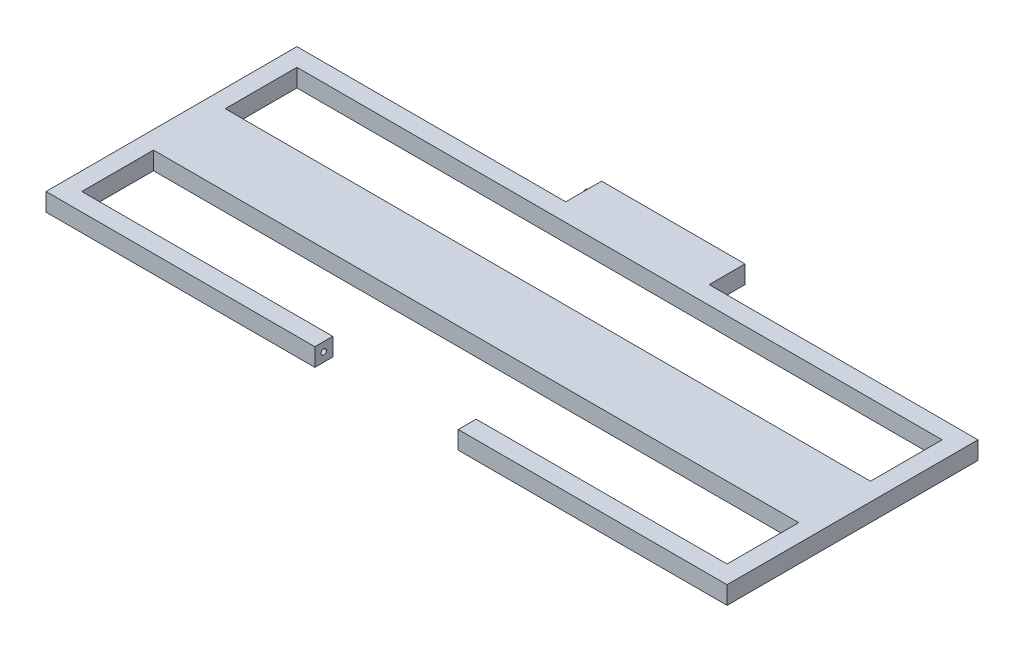
ISO-10303-21;
HEADER;
FILE_DESCRIPTION(('STEP AP214'),'2;1');
FILE_NAME('part.step','',(''),(''),'','','');
FILE_SCHEMA(('AUTOMOTIVE_DESIGN { 1 0 10303 214 1 1 1 1 }'));
ENDSEC;
DATA;
#1=APPLICATION_CONTEXT('core data for automotive mechanical design processes');
#2=APPLICATION_PROTOCOL_DEFINITION('international standard','automotive_design',2000,#1);
#3=PRODUCT_CONTEXT('',#1,'mechanical');
#4=PRODUCT('Part','Part','',(#3));
#5=PRODUCT_RELATED_PRODUCT_CATEGORY('part','',(#4));
#6=PRODUCT_DEFINITION_FORMATION('','',#4);
#7=PRODUCT_DEFINITION_CONTEXT('part definition',#1,'design');
#8=PRODUCT_DEFINITION('design','',#6,#7);
#9=PRODUCT_DEFINITION_SHAPE('','',#8);
#10=(LENGTH_UNIT() NAMED_UNIT(*) SI_UNIT(.MILLI.,.METRE.));
#11=(NAMED_UNIT(*) PLANE_ANGLE_UNIT() SI_UNIT($,.RADIAN.));
#12=(NAMED_UNIT(*) SI_UNIT($,.STERADIAN.) SOLID_ANGLE_UNIT());
#13=UNCERTAINTY_MEASURE_WITH_UNIT(LENGTH_MEASURE(1.E-05),#10,'distance_accuracy_value','');
#14=(GEOMETRIC_REPRESENTATION_CONTEXT(3) GLOBAL_UNCERTAINTY_ASSIGNED_CONTEXT((#13)) GLOBAL_UNIT_ASSIGNED_CONTEXT((#10,
#11,#12)) REPRESENTATION_CONTEXT('',''));
#15=CARTESIAN_POINT('',(0.,0.,0.));
#16=DIRECTION('',(0.,0.,1.));
#17=DIRECTION('',(1.,0.,0.));
#18=AXIS2_PLACEMENT_3D('',#15,#16,#17);
#19=CARTESIAN_POINT('',(0.,0.,250.));
#20=DIRECTION('',(0.,0.,1.));
#21=DIRECTION('',(1.,0.,0.));
#22=AXIS2_PLACEMENT_3D('',#19,#20,#21);
#23=PLANE('',#22);
#24=DIRECTION('',(0.,1.,0.));
#25=VECTOR('',#24,1.);
#26=CARTESIAN_POINT('',(-100.,0.,250.));
#27=LINE('',#26,#25);
#28=CARTESIAN_POINT('',(-99.9999999999998,0.,250.));
#29=VERTEX_POINT('',#28);
#30=CARTESIAN_POINT('',(-99.9999999999998,25.,250.));
#31=VERTEX_POINT('',#30);
#32=EDGE_CURVE('E395',#29,#31,#27,.T.);
#33=ORIENTED_EDGE('',*,*,#32,.F.);
#34=DIRECTION('',(-1.,0.,0.));
#35=VECTOR('',#34,1.);
#36=CARTESIAN_POINT('',(475.,0.,250.));
#37=LINE('',#36,#35);
#38=CARTESIAN_POINT('',(-475.,0.,250.));
#39=VERTEX_POINT('',#38);
#40=EDGE_CURVE('E401',#29,#39,#37,.T.);
#41=ORIENTED_EDGE('',*,*,#40,.T.);
#42=DIRECTION('',(0.,1.,0.));
#43=VECTOR('',#42,1.);
#44=CARTESIAN_POINT('',(-475.,0.,250.));
#45=LINE('',#44,#43);
#46=CARTESIAN_POINT('',(-475.,25.,250.));
#47=VERTEX_POINT('',#46);
#48=EDGE_CURVE('E410',#39,#47,#45,.T.);
#49=ORIENTED_EDGE('',*,*,#48,.T.);
#50=DIRECTION('',(1.,0.,0.));
#51=VECTOR('',#50,1.);
#52=CARTESIAN_POINT('',(475.,25.,250.));
#53=LINE('',#52,#51);
#54=EDGE_CURVE('E257',#47,#31,#53,.T.);
#55=ORIENTED_EDGE('',*,*,#54,.T.);
#56=EDGE_LOOP('',(#33,#41,#49,#55));
#57=FACE_BOUND('',#56,.T.);
#58=ADVANCED_FACE('F233',(#57),#23,.F.);
#59=DIRECTION('',(0.,-1.,0.));
#60=VECTOR('',#59,1.);
#61=CARTESIAN_POINT('',(100.,0.,250.));
#62=LINE('',#61,#60);
#63=CARTESIAN_POINT('',(100.,25.,250.));
#64=VERTEX_POINT('',#63);
#65=CARTESIAN_POINT('',(100.,0.,250.));
#66=VERTEX_POINT('',#65);
#67=EDGE_CURVE('E249',#64,#66,#62,.T.);
#68=ORIENTED_EDGE('',*,*,#67,.F.);
#69=CARTESIAN_POINT('',(475.,25.,250.));
#70=VERTEX_POINT('',#69);
#71=EDGE_CURVE('E413',#64,#70,#53,.T.);
#72=ORIENTED_EDGE('',*,*,#71,.T.);
#73=DIRECTION('',(0.,-1.,0.));
#74=VECTOR('',#73,1.);
#75=CARTESIAN_POINT('',(475.,0.,250.));
#76=LINE('',#75,#74);
#77=CARTESIAN_POINT('',(475.,0.,250.));
#78=VERTEX_POINT('',#77);
#79=EDGE_CURVE('E397',#70,#78,#76,.T.);
#80=ORIENTED_EDGE('',*,*,#79,.T.);
#81=EDGE_CURVE('E407',#78,#66,#37,.T.);
#82=ORIENTED_EDGE('',*,*,#81,.T.);
#83=EDGE_LOOP('',(#68,#72,#80,#82));
#84=FACE_BOUND('',#83,.T.);
#85=ADVANCED_FACE('F622',(#84),#23,.F.);
#86=CARTESIAN_POINT('',(0.,25.,475.));
#87=DIRECTION('',(0.,0.,-1.));
#88=DIRECTION('',(-1.,0.,0.));
#89=AXIS2_PLACEMENT_3D('',#86,#87,#88);
#90=PLANE('',#89);
#91=DIRECTION('',(1.,0.,0.));
#92=VECTOR('',#91,1.);
#93=CARTESIAN_POINT('',(0.,0.,475.));
#94=LINE('',#93,#92);
#95=CARTESIAN_POINT('',(-450.,0.,475.));
#96=VERTEX_POINT('',#95);
#97=CARTESIAN_POINT('',(450.,0.,475.));
#98=VERTEX_POINT('',#97);
#99=EDGE_CURVE('E435',#96,#98,#94,.T.);
#100=ORIENTED_EDGE('',*,*,#99,.T.);
#101=DIRECTION('',(0.,-1.,0.));
#102=VECTOR('',#101,1.);
#103=CARTESIAN_POINT('',(450.,25.,475.));
#104=LINE('',#103,#102);
#105=CARTESIAN_POINT('',(450.,25.,475.));
#106=VERTEX_POINT('',#105);
#107=EDGE_CURVE('E448',#106,#98,#104,.T.);
#108=ORIENTED_EDGE('',*,*,#107,.F.);
#109=DIRECTION('',(1.,0.,0.));
#110=VECTOR('',#109,1.);
#111=CARTESIAN_POINT('',(0.,25.,475.));
#112=LINE('',#111,#110);
#113=CARTESIAN_POINT('',(-450.,25.,475.));
#114=VERTEX_POINT('',#113);
#115=EDGE_CURVE('E425',#114,#106,#112,.T.);
#116=ORIENTED_EDGE('',*,*,#115,.F.);
#117=DIRECTION('',(0.,-1.,0.));
#118=VECTOR('',#117,1.);
#119=CARTESIAN_POINT('',(-450.,25.,475.));
#120=LINE('',#119,#118);
#121=EDGE_CURVE('E242',#114,#96,#120,.T.);
#122=ORIENTED_EDGE('',*,*,#121,.T.);
#123=EDGE_LOOP('',(#100,#108,#116,#122));
#124=FACE_BOUND('',#123,.T.);
#125=ADVANCED_FACE('F598',(#124),#90,.F.);
#126=CARTESIAN_POINT('',(0.,25.,375.));
#127=DIRECTION('',(0.,0.,-1.));
#128=DIRECTION('',(-1.,0.,0.));
#129=AXIS2_PLACEMENT_3D('',#126,#127,#128);
#130=PLANE('',#129);
#131=DIRECTION('',(1.,0.,0.));
#132=VECTOR('',#131,1.);
#133=CARTESIAN_POINT('',(0.,0.,375.));
#134=LINE('',#133,#132);
#135=CARTESIAN_POINT('',(-450.,0.,375.));
#136=VERTEX_POINT('',#135);
#137=CARTESIAN_POINT('',(450.,0.,375.));
#138=VERTEX_POINT('',#137);
#139=EDGE_CURVE('E430',#136,#138,#134,.T.);
#140=ORIENTED_EDGE('',*,*,#139,.F.);
#141=DIRECTION('',(0.,-1.,0.));
#142=VECTOR('',#141,1.);
#143=CARTESIAN_POINT('',(-450.,25.,375.));
#144=LINE('',#143,#142);
#145=CARTESIAN_POINT('',(-450.,25.,375.));
#146=VERTEX_POINT('',#145);
#147=EDGE_CURVE('E434',#146,#136,#144,.T.);
#148=ORIENTED_EDGE('',*,*,#147,.F.);
#149=DIRECTION('',(1.,0.,0.));
#150=VECTOR('',#149,1.);
#151=CARTESIAN_POINT('',(0.,25.,375.));
#152=LINE('',#151,#150);
#153=CARTESIAN_POINT('',(450.,25.,375.));
#154=VERTEX_POINT('',#153);
#155=EDGE_CURVE('E429',#146,#154,#152,.T.);
#156=ORIENTED_EDGE('',*,*,#155,.T.);
#157=DIRECTION('',(0.,-1.,0.));
#158=VECTOR('',#157,1.);
#159=CARTESIAN_POINT('',(450.,25.,375.));
#160=LINE('',#159,#158);
#161=EDGE_CURVE('E445',#154,#138,#160,.T.);
#162=ORIENTED_EDGE('',*,*,#161,.T.);
#163=EDGE_LOOP('',(#140,#148,#156,#162));
#164=FACE_BOUND('',#163,.T.);
#165=ADVANCED_FACE('F678',(#164),#130,.T.);
#166=CARTESIAN_POINT('',(0.,0.,0.));
#167=DIRECTION('',(0.,1.,0.));
#168=DIRECTION('',(0.,0.,1.));
#169=AXIS2_PLACEMENT_3D('',#166,#167,#168);
#170=PLANE('',#169);
#171=DIRECTION('',(0.,0.,-1.));
#172=VECTOR('',#171,1.);
#173=CARTESIAN_POINT('',(-450.,0.,575.));
#174=LINE('',#173,#172);
#175=CARTESIAN_POINT('',(-450.,0.,275.));
#176=VERTEX_POINT('',#175);
#177=EDGE_CURVE('E522',#136,#176,#174,.T.);
#178=ORIENTED_EDGE('',*,*,#177,.F.);
#179=ORIENTED_EDGE('',*,*,#139,.T.);
#180=DIRECTION('',(0.,0.,-1.));
#181=VECTOR('',#180,1.);
#182=CARTESIAN_POINT('',(450.,0.,575.));
#183=LINE('',#182,#181);
#184=CARTESIAN_POINT('',(450.,0.,275.));
#185=VERTEX_POINT('',#184);
#186=EDGE_CURVE('E527',#138,#185,#183,.T.);
#187=ORIENTED_EDGE('',*,*,#186,.T.);
#188=DIRECTION('',(1.,0.,0.));
#189=VECTOR('',#188,1.);
#190=CARTESIAN_POINT('',(0.,0.,275.));
#191=LINE('',#190,#189);
#192=EDGE_CURVE('E458',#176,#185,#191,.T.);
#193=ORIENTED_EDGE('',*,*,#192,.F.);
#194=EDGE_LOOP('',(#178,#179,#187,#193));
#195=FACE_BOUND('',#194,.T.);
#196=DIRECTION('',(0.,0.,-1.));
#197=VECTOR('',#196,1.);
#198=CARTESIAN_POINT('',(-475.,0.,600.));
#199=LINE('',#198,#197);
#200=CARTESIAN_POINT('',(-475.,0.,600.));
#201=VERTEX_POINT('',#200);
#202=EDGE_CURVE('E474',#201,#39,#199,.T.);
#203=ORIENTED_EDGE('',*,*,#202,.T.);
#204=ORIENTED_EDGE('',*,*,#40,.F.);
#205=DIRECTION('',(0.,0.,1.));
#206=VECTOR('',#205,1.);
#207=CARTESIAN_POINT('',(-100.,0.,200.));
#208=LINE('',#207,#206);
#209=CARTESIAN_POINT('',(-100.,0.,200.));
#210=VERTEX_POINT('',#209);
#211=EDGE_CURVE('E627',#210,#29,#208,.T.);
#212=ORIENTED_EDGE('',*,*,#211,.F.);
#213=DIRECTION('',(-1.,0.,0.));
#214=VECTOR('',#213,1.);
#215=CARTESIAN_POINT('',(100.,0.,200.));
#216=LINE('',#215,#214);
#217=CARTESIAN_POINT('',(100.,0.,200.));
#218=VERTEX_POINT('',#217);
#219=EDGE_CURVE('E388',#218,#210,#216,.T.);
#220=ORIENTED_EDGE('',*,*,#219,.F.);
#221=DIRECTION('',(0.,0.,1.));
#222=VECTOR('',#221,1.);
#223=CARTESIAN_POINT('',(100.,0.,200.));
#224=LINE('',#223,#222);
#225=EDGE_CURVE('E403',#218,#66,#224,.T.);
#226=ORIENTED_EDGE('',*,*,#225,.T.);
#227=ORIENTED_EDGE('',*,*,#81,.F.);
#228=DIRECTION('',(0.,0.,-1.));
#229=VECTOR('',#228,1.);
#230=CARTESIAN_POINT('',(475.,0.,600.));
#231=LINE('',#230,#229);
#232=CARTESIAN_POINT('',(475.,0.,600.));
#233=VERTEX_POINT('',#232);
#234=EDGE_CURVE('E543',#233,#78,#231,.T.);
#235=ORIENTED_EDGE('',*,*,#234,.F.);
#236=DIRECTION('',(1.,0.,0.));
#237=VECTOR('',#236,1.);
#238=CARTESIAN_POINT('',(99.9999999999999,0.,600.));
#239=LINE('',#238,#237);
#240=CARTESIAN_POINT('',(99.9999999999999,0.,600.));
#241=VERTEX_POINT('',#240);
#242=EDGE_CURVE('E540',#241,#233,#239,.T.);
#243=ORIENTED_EDGE('',*,*,#242,.F.);
#244=DIRECTION('',(0.,0.,-1.));
#245=VECTOR('',#244,1.);
#246=CARTESIAN_POINT('',(99.9999999999999,0.,600.));
#247=LINE('',#246,#245);
#248=CARTESIAN_POINT('',(99.9999999999998,0.,575.));
#249=VERTEX_POINT('',#248);
#250=EDGE_CURVE('E536',#241,#249,#247,.T.);
#251=ORIENTED_EDGE('',*,*,#250,.T.);
#252=DIRECTION('',(1.,0.,0.));
#253=VECTOR('',#252,1.);
#254=CARTESIAN_POINT('',(99.9999999999998,0.,575.));
#255=LINE('',#254,#253);
#256=CARTESIAN_POINT('',(450.,0.,575.));
#257=VERTEX_POINT('',#256);
#258=EDGE_CURVE('E532',#249,#257,#255,.T.);
#259=ORIENTED_EDGE('',*,*,#258,.T.);
#260=EDGE_CURVE('E528',#257,#98,#183,.T.);
#261=ORIENTED_EDGE('',*,*,#260,.T.);
#262=ORIENTED_EDGE('',*,*,#99,.F.);
#263=CARTESIAN_POINT('',(-450.,0.,575.));
#264=VERTEX_POINT('',#263);
#265=EDGE_CURVE('E523',#264,#96,#174,.T.);
#266=ORIENTED_EDGE('',*,*,#265,.F.);
#267=DIRECTION('',(1.,0.,0.));
#268=VECTOR('',#267,1.);
#269=CARTESIAN_POINT('',(-450.,0.,575.));
#270=LINE('',#269,#268);
#271=CARTESIAN_POINT('',(-100.,0.,575.));
#272=VERTEX_POINT('',#271);
#273=EDGE_CURVE('E518',#264,#272,#270,.T.);
#274=ORIENTED_EDGE('',*,*,#273,.T.);
#275=DIRECTION('',(0.,0.,-1.));
#276=VECTOR('',#275,1.);
#277=CARTESIAN_POINT('',(-100.,0.,600.));
#278=LINE('',#277,#276);
#279=CARTESIAN_POINT('',(-100.,0.,600.));
#280=VERTEX_POINT('',#279);
#281=EDGE_CURVE('E514',#280,#272,#278,.T.);
#282=ORIENTED_EDGE('',*,*,#281,.F.);
#283=DIRECTION('',(1.,0.,0.));
#284=VECTOR('',#283,1.);
#285=CARTESIAN_POINT('',(-475.,0.,600.));
#286=LINE('',#285,#284);
#287=EDGE_CURVE('E421',#201,#280,#286,.T.);
#288=ORIENTED_EDGE('',*,*,#287,.F.);
#289=EDGE_LOOP('',(#203,#204,#212,#220,#226,#227,#235,#243,#251,#259,#261,#262,#266,#274,#282,#288));
#290=FACE_BOUND('',#289,.T.);
#291=ADVANCED_FACE('F581',(#195,#290),#170,.F.);
#292=CARTESIAN_POINT('',(0.,25.,0.));
#293=DIRECTION('',(0.,1.,0.));
#294=DIRECTION('',(0.,0.,1.));
#295=AXIS2_PLACEMENT_3D('',#292,#293,#294);
#296=PLANE('',#295);
#297=ORIENTED_EDGE('',*,*,#54,.F.);
#298=DIRECTION('',(0.,0.,-1.));
#299=VECTOR('',#298,1.);
#300=CARTESIAN_POINT('',(-475.,25.,600.));
#301=LINE('',#300,#299);
#302=CARTESIAN_POINT('',(-475.,25.,600.));
#303=VERTEX_POINT('',#302);
#304=EDGE_CURVE('E506',#303,#47,#301,.T.);
#305=ORIENTED_EDGE('',*,*,#304,.F.);
#306=DIRECTION('',(1.,0.,0.));
#307=VECTOR('',#306,1.);
#308=CARTESIAN_POINT('',(-475.,25.,600.));
#309=LINE('',#308,#307);
#310=CARTESIAN_POINT('',(-100.,25.,600.));
#311=VERTEX_POINT('',#310);
#312=EDGE_CURVE('E469',#303,#311,#309,.T.);
#313=ORIENTED_EDGE('',*,*,#312,.T.);
#314=DIRECTION('',(0.,0.,-1.));
#315=VECTOR('',#314,1.);
#316=CARTESIAN_POINT('',(-100.,25.,600.));
#317=LINE('',#316,#315);
#318=CARTESIAN_POINT('',(-100.,25.,575.));
#319=VERTEX_POINT('',#318);
#320=EDGE_CURVE('E473',#311,#319,#317,.T.);
#321=ORIENTED_EDGE('',*,*,#320,.T.);
#322=DIRECTION('',(1.,0.,0.));
#323=VECTOR('',#322,1.);
#324=CARTESIAN_POINT('',(-450.,25.,575.));
#325=LINE('',#324,#323);
#326=CARTESIAN_POINT('',(-450.,25.,575.));
#327=VERTEX_POINT('',#326);
#328=EDGE_CURVE('E477',#327,#319,#325,.T.);
#329=ORIENTED_EDGE('',*,*,#328,.F.);
#330=DIRECTION('',(0.,0.,-1.));
#331=VECTOR('',#330,1.);
#332=CARTESIAN_POINT('',(-450.,25.,575.));
#333=LINE('',#332,#331);
#334=EDGE_CURVE('E482',#327,#114,#333,.T.);
#335=ORIENTED_EDGE('',*,*,#334,.T.);
#336=ORIENTED_EDGE('',*,*,#115,.T.);
#337=DIRECTION('',(0.,0.,-1.));
#338=VECTOR('',#337,1.);
#339=CARTESIAN_POINT('',(450.,25.,575.));
#340=LINE('',#339,#338);
#341=CARTESIAN_POINT('',(450.,25.,575.));
#342=VERTEX_POINT('',#341);
#343=EDGE_CURVE('E487',#342,#106,#340,.T.);
#344=ORIENTED_EDGE('',*,*,#343,.F.);
#345=DIRECTION('',(1.,0.,0.));
#346=VECTOR('',#345,1.);
#347=CARTESIAN_POINT('',(99.9999999999998,25.,575.));
#348=LINE('',#347,#346);
#349=CARTESIAN_POINT('',(99.9999999999998,25.,575.));
#350=VERTEX_POINT('',#349);
#351=EDGE_CURVE('E491',#350,#342,#348,.T.);
#352=ORIENTED_EDGE('',*,*,#351,.F.);
#353=DIRECTION('',(0.,0.,-1.));
#354=VECTOR('',#353,1.);
#355=CARTESIAN_POINT('',(99.9999999999999,25.,600.));
#356=LINE('',#355,#354);
#357=CARTESIAN_POINT('',(99.9999999999999,25.,600.));
#358=VERTEX_POINT('',#357);
#359=EDGE_CURVE('E495',#358,#350,#356,.T.);
#360=ORIENTED_EDGE('',*,*,#359,.F.);
#361=DIRECTION('',(1.,0.,0.));
#362=VECTOR('',#361,1.);
#363=CARTESIAN_POINT('',(99.9999999999999,25.,600.));
#364=LINE('',#363,#362);
#365=CARTESIAN_POINT('',(475.,25.,600.));
#366=VERTEX_POINT('',#365);
#367=EDGE_CURVE('E499',#358,#366,#364,.T.);
#368=ORIENTED_EDGE('',*,*,#367,.T.);
#369=DIRECTION('',(0.,0.,-1.));
#370=VECTOR('',#369,1.);
#371=CARTESIAN_POINT('',(475.,25.,600.));
#372=LINE('',#371,#370);
#373=EDGE_CURVE('E502',#366,#70,#372,.T.);
#374=ORIENTED_EDGE('',*,*,#373,.T.);
#375=ORIENTED_EDGE('',*,*,#71,.F.);
#376=DIRECTION('',(0.,0.,1.));
#377=VECTOR('',#376,1.);
#378=CARTESIAN_POINT('',(100.,25.,200.));
#379=LINE('',#378,#377);
#380=CARTESIAN_POINT('',(100.,25.,200.));
#381=VERTEX_POINT('',#380);
#382=EDGE_CURVE('E378',#381,#64,#379,.T.);
#383=ORIENTED_EDGE('',*,*,#382,.F.);
#384=DIRECTION('',(1.,0.,0.));
#385=VECTOR('',#384,1.);
#386=CARTESIAN_POINT('',(100.,25.,200.));
#387=LINE('',#386,#385);
#388=CARTESIAN_POINT('',(-100.,25.,200.));
#389=VERTEX_POINT('',#388);
#390=EDGE_CURVE('E370',#389,#381,#387,.T.);
#391=ORIENTED_EDGE('',*,*,#390,.F.);
#392=DIRECTION('',(0.,0.,1.));
#393=VECTOR('',#392,1.);
#394=CARTESIAN_POINT('',(-100.,25.,200.));
#395=LINE('',#394,#393);
#396=EDGE_CURVE('E375',#389,#31,#395,.T.);
#397=ORIENTED_EDGE('',*,*,#396,.T.);
#398=EDGE_LOOP('',(#297,#305,#313,#321,#329,#335,#336,#344,#352,#360,#368,#374,#375,#383,#391,#397));
#399=FACE_BOUND('',#398,.T.);
#400=ORIENTED_EDGE('',*,*,#155,.F.);
#401=CARTESIAN_POINT('',(-450.,25.,275.));
#402=VERTEX_POINT('',#401);
#403=EDGE_CURVE('E481',#146,#402,#333,.T.);
#404=ORIENTED_EDGE('',*,*,#403,.T.);
#405=DIRECTION('',(1.,0.,0.));
#406=VECTOR('',#405,1.);
#407=CARTESIAN_POINT('',(0.,25.,275.));
#408=LINE('',#407,#406);
#409=CARTESIAN_POINT('',(450.,25.,275.));
#410=VERTEX_POINT('',#409);
#411=EDGE_CURVE('E453',#402,#410,#408,.T.);
#412=ORIENTED_EDGE('',*,*,#411,.T.);
#413=EDGE_CURVE('E486',#154,#410,#340,.T.);
#414=ORIENTED_EDGE('',*,*,#413,.F.);
#415=EDGE_LOOP('',(#400,#404,#412,#414));
#416=FACE_BOUND('',#415,.T.);
#417=ADVANCED_FACE('F372',(#399,#416),#296,.T.);
#418=CARTESIAN_POINT('',(0.,25.,275.));
#419=DIRECTION('',(0.,0.,-1.));
#420=DIRECTION('',(-1.,0.,0.));
#421=AXIS2_PLACEMENT_3D('',#418,#419,#420);
#422=PLANE('',#421);
#423=ORIENTED_EDGE('',*,*,#192,.T.);
#424=DIRECTION('',(0.,-1.,0.));
#425=VECTOR('',#424,1.);
#426=CARTESIAN_POINT('',(450.,25.,275.));
#427=LINE('',#426,#425);
#428=EDGE_CURVE('E457',#410,#185,#427,.T.);
#429=ORIENTED_EDGE('',*,*,#428,.F.);
#430=ORIENTED_EDGE('',*,*,#411,.F.);
#431=DIRECTION('',(0.,-1.,0.));
#432=VECTOR('',#431,1.);
#433=CARTESIAN_POINT('',(-450.,25.,275.));
#434=LINE('',#433,#432);
#435=EDGE_CURVE('E439',#402,#176,#434,.T.);
#436=ORIENTED_EDGE('',*,*,#435,.T.);
#437=EDGE_LOOP('',(#423,#429,#430,#436));
#438=FACE_BOUND('',#437,.T.);
#439=ADVANCED_FACE('F675',(#438),#422,.F.);
#440=CARTESIAN_POINT('',(-100.,25.,600.));
#441=DIRECTION('',(-1.,0.,0.));
#442=DIRECTION('',(0.,0.,1.));
#443=AXIS2_PLACEMENT_3D('',#440,#441,#442);
#444=PLANE('',#443);
#445=CARTESIAN_POINT('',(-100.,12.5000000000001,587.5));
#446=DIRECTION('',(1.,0.,0.));
#447=DIRECTION('',(0.,0.,-1.));
#448=AXIS2_PLACEMENT_3D('',#445,#446,#447);
#449=CIRCLE('',#448,3.74999999999998);
#450=CARTESIAN_POINT('',(-100.,12.5000000000001,583.75));
#451=VERTEX_POINT('',#450);
#452=EDGE_CURVE('E416',#451,#451,#449,.T.);
#453=ORIENTED_EDGE('',*,*,#452,.F.);
#454=EDGE_LOOP('',(#453));
#455=FACE_BOUND('',#454,.T.);
#456=ORIENTED_EDGE('',*,*,#281,.T.);
#457=DIRECTION('',(0.,-1.,0.));
#458=VECTOR('',#457,1.);
#459=CARTESIAN_POINT('',(-100.,25.,575.));
#460=LINE('',#459,#458);
#461=EDGE_CURVE('E568',#319,#272,#460,.T.);
#462=ORIENTED_EDGE('',*,*,#461,.F.);
#463=ORIENTED_EDGE('',*,*,#320,.F.);
#464=DIRECTION('',(0.,-1.,0.));
#465=VECTOR('',#464,1.);
#466=CARTESIAN_POINT('',(-100.,25.,600.));
#467=LINE('',#466,#465);
#468=EDGE_CURVE('E462',#311,#280,#467,.T.);
#469=ORIENTED_EDGE('',*,*,#468,.T.);
#470=EDGE_LOOP('',(#456,#462,#463,#469));
#471=FACE_BOUND('',#470,.T.);
#472=ADVANCED_FACE('F574',(#455,#471),#444,.F.);
#473=CARTESIAN_POINT('',(-450.,25.,575.));
#474=DIRECTION('',(0.,0.,-1.));
#475=DIRECTION('',(-1.,0.,0.));
#476=AXIS2_PLACEMENT_3D('',#473,#474,#475);
#477=PLANE('',#476);
#478=ORIENTED_EDGE('',*,*,#273,.F.);
#479=DIRECTION('',(0.,-1.,0.));
#480=VECTOR('',#479,1.);
#481=CARTESIAN_POINT('',(-450.,25.,575.));
#482=LINE('',#481,#480);
#483=EDGE_CURVE('E565',#327,#264,#482,.T.);
#484=ORIENTED_EDGE('',*,*,#483,.F.);
#485=ORIENTED_EDGE('',*,*,#328,.T.);
#486=ORIENTED_EDGE('',*,*,#461,.T.);
#487=EDGE_LOOP('',(#478,#484,#485,#486));
#488=FACE_BOUND('',#487,.T.);
#489=ADVANCED_FACE('F590',(#488),#477,.T.);
#490=CARTESIAN_POINT('',(-450.,25.,575.));
#491=DIRECTION('',(-1.,0.,0.));
#492=DIRECTION('',(0.,0.,1.));
#493=AXIS2_PLACEMENT_3D('',#490,#491,#492);
#494=PLANE('',#493);
#495=ORIENTED_EDGE('',*,*,#265,.T.);
#496=ORIENTED_EDGE('',*,*,#121,.F.);
#497=ORIENTED_EDGE('',*,*,#334,.F.);
#498=ORIENTED_EDGE('',*,*,#483,.T.);
#499=EDGE_LOOP('',(#495,#496,#497,#498));
#500=FACE_BOUND('',#499,.T.);
#501=ADVANCED_FACE('F594',(#500),#494,.F.);
#502=ORIENTED_EDGE('',*,*,#147,.T.);
#503=ORIENTED_EDGE('',*,*,#177,.T.);
#504=ORIENTED_EDGE('',*,*,#435,.F.);
#505=ORIENTED_EDGE('',*,*,#403,.F.);
#506=EDGE_LOOP('',(#502,#503,#504,#505));
#507=FACE_BOUND('',#506,.T.);
#508=ADVANCED_FACE('F703',(#507),#494,.F.);
#509=CARTESIAN_POINT('',(450.,25.,575.));
#510=DIRECTION('',(-1.,0.,0.));
#511=DIRECTION('',(0.,0.,1.));
#512=AXIS2_PLACEMENT_3D('',#509,#510,#511);
#513=PLANE('',#512);
#514=ORIENTED_EDGE('',*,*,#186,.F.);
#515=ORIENTED_EDGE('',*,*,#161,.F.);
#516=ORIENTED_EDGE('',*,*,#413,.T.);
#517=ORIENTED_EDGE('',*,*,#428,.T.);
#518=EDGE_LOOP('',(#514,#515,#516,#517));
#519=FACE_BOUND('',#518,.T.);
#520=ADVANCED_FACE('F698',(#519),#513,.T.);
#521=ORIENTED_EDGE('',*,*,#343,.T.);
#522=ORIENTED_EDGE('',*,*,#107,.T.);
#523=ORIENTED_EDGE('',*,*,#260,.F.);
#524=DIRECTION('',(0.,-1.,0.));
#525=VECTOR('',#524,1.);
#526=CARTESIAN_POINT('',(450.,25.,575.));
#527=LINE('',#526,#525);
#528=EDGE_CURVE('E562',#342,#257,#527,.T.);
#529=ORIENTED_EDGE('',*,*,#528,.F.);
#530=EDGE_LOOP('',(#521,#522,#523,#529));
#531=FACE_BOUND('',#530,.T.);
#532=ADVANCED_FACE('F602',(#531),#513,.T.);
#533=CARTESIAN_POINT('',(99.9999999999998,25.,575.));
#534=DIRECTION('',(0.,0.,-1.));
#535=DIRECTION('',(-1.,0.,0.));
#536=AXIS2_PLACEMENT_3D('',#533,#534,#535);
#537=PLANE('',#536);
#538=ORIENTED_EDGE('',*,*,#258,.F.);
#539=DIRECTION('',(0.,-1.,0.));
#540=VECTOR('',#539,1.);
#541=CARTESIAN_POINT('',(99.9999999999998,25.,575.));
#542=LINE('',#541,#540);
#543=EDGE_CURVE('E559',#350,#249,#542,.T.);
#544=ORIENTED_EDGE('',*,*,#543,.F.);
#545=ORIENTED_EDGE('',*,*,#351,.T.);
#546=ORIENTED_EDGE('',*,*,#528,.T.);
#547=EDGE_LOOP('',(#538,#544,#545,#546));
#548=FACE_BOUND('',#547,.T.);
#549=ADVANCED_FACE('F607',(#548),#537,.T.);
#550=CARTESIAN_POINT('',(99.9999999999999,25.,600.));
#551=DIRECTION('',(-1.,0.,0.));
#552=DIRECTION('',(0.,0.,1.));
#553=AXIS2_PLACEMENT_3D('',#550,#551,#552);
#554=PLANE('',#553);
#555=ORIENTED_EDGE('',*,*,#250,.F.);
#556=DIRECTION('',(0.,-1.,0.));
#557=VECTOR('',#556,1.);
#558=CARTESIAN_POINT('',(99.9999999999999,25.,600.));
#559=LINE('',#558,#557);
#560=EDGE_CURVE('E556',#358,#241,#559,.T.);
#561=ORIENTED_EDGE('',*,*,#560,.F.);
#562=ORIENTED_EDGE('',*,*,#359,.T.);
#563=ORIENTED_EDGE('',*,*,#543,.T.);
#564=EDGE_LOOP('',(#555,#561,#562,#563));
#565=FACE_BOUND('',#564,.T.);
#566=ADVANCED_FACE('F610',(#565),#554,.T.);
#567=CARTESIAN_POINT('',(99.9999999999999,25.,600.));
#568=DIRECTION('',(0.,0.,-1.));
#569=DIRECTION('',(-1.,0.,0.));
#570=AXIS2_PLACEMENT_3D('',#567,#568,#569);
#571=PLANE('',#570);
#572=ORIENTED_EDGE('',*,*,#242,.T.);
#573=DIRECTION('',(0.,-1.,0.));
#574=VECTOR('',#573,1.);
#575=CARTESIAN_POINT('',(475.,25.,600.));
#576=LINE('',#575,#574);
#577=EDGE_CURVE('E552',#366,#233,#576,.T.);
#578=ORIENTED_EDGE('',*,*,#577,.F.);
#579=ORIENTED_EDGE('',*,*,#367,.F.);
#580=ORIENTED_EDGE('',*,*,#560,.T.);
#581=EDGE_LOOP('',(#572,#578,#579,#580));
#582=FACE_BOUND('',#581,.T.);
#583=ADVANCED_FACE('F615',(#582),#571,.F.);
#584=CARTESIAN_POINT('',(475.,25.,600.));
#585=DIRECTION('',(-1.,0.,0.));
#586=DIRECTION('',(0.,0.,1.));
#587=AXIS2_PLACEMENT_3D('',#584,#585,#586);
#588=PLANE('',#587);
#589=ORIENTED_EDGE('',*,*,#234,.T.);
#590=ORIENTED_EDGE('',*,*,#79,.F.);
#591=ORIENTED_EDGE('',*,*,#373,.F.);
#592=ORIENTED_EDGE('',*,*,#577,.T.);
#593=EDGE_LOOP('',(#589,#590,#591,#592));
#594=FACE_BOUND('',#593,.T.);
#595=ADVANCED_FACE('F620',(#594),#588,.F.);
#596=CARTESIAN_POINT('',(-475.,25.,600.));
#597=DIRECTION('',(-1.,0.,0.));
#598=DIRECTION('',(0.,0.,1.));
#599=AXIS2_PLACEMENT_3D('',#596,#597,#598);
#600=PLANE('',#599);
#601=ORIENTED_EDGE('',*,*,#48,.F.);
#602=ORIENTED_EDGE('',*,*,#202,.F.);
#603=DIRECTION('',(0.,-1.,0.));
#604=VECTOR('',#603,1.);
#605=CARTESIAN_POINT('',(-475.,25.,600.));
#606=LINE('',#605,#604);
#607=EDGE_CURVE('E510',#303,#201,#606,.T.);
#608=ORIENTED_EDGE('',*,*,#607,.F.);
#609=ORIENTED_EDGE('',*,*,#304,.T.);
#610=EDGE_LOOP('',(#601,#602,#608,#609));
#611=FACE_BOUND('',#610,.T.);
#612=ADVANCED_FACE('F585',(#611),#600,.T.);
#613=CARTESIAN_POINT('',(-475.,25.,600.));
#614=DIRECTION('',(0.,0.,-1.));
#615=DIRECTION('',(-1.,0.,0.));
#616=AXIS2_PLACEMENT_3D('',#613,#614,#615);
#617=PLANE('',#616);
#618=ORIENTED_EDGE('',*,*,#287,.T.);
#619=ORIENTED_EDGE('',*,*,#468,.F.);
#620=ORIENTED_EDGE('',*,*,#312,.F.);
#621=ORIENTED_EDGE('',*,*,#607,.T.);
#622=EDGE_LOOP('',(#618,#619,#620,#621));
#623=FACE_BOUND('',#622,.T.);
#624=ADVANCED_FACE('F235',(#623),#617,.F.);
#625=CARTESIAN_POINT('',(-110.,12.5000000000001,587.5));
#626=DIRECTION('',(1.,0.,0.));
#627=DIRECTION('',(0.,0.,-1.));
#628=AXIS2_PLACEMENT_3D('',#625,#626,#627);
#629=CYLINDRICAL_SURFACE('',#628,3.74999999999998);
#630=CARTESIAN_POINT('',(-110.,12.5000000000001,587.5));
#631=DIRECTION('',(1.,0.,0.));
#632=DIRECTION('',(0.,0.,-1.));
#633=AXIS2_PLACEMENT_3D('',#630,#631,#632);
#634=CIRCLE('',#633,3.74999999999998);
#635=CARTESIAN_POINT('',(-110.,12.5000000000001,583.75));
#636=VERTEX_POINT('',#635);
#637=EDGE_CURVE('E417',#636,#636,#634,.T.);
#638=ORIENTED_EDGE('',*,*,#637,.F.);
#639=EDGE_LOOP('',(#638));
#640=FACE_BOUND('',#639,.T.);
#641=ORIENTED_EDGE('',*,*,#452,.T.);
#642=EDGE_LOOP('',(#641));
#643=FACE_BOUND('',#642,.T.);
#644=ADVANCED_FACE('F661',(#640,#643),#629,.F.);
#645=CARTESIAN_POINT('',(-110.,0.,0.));
#646=DIRECTION('',(1.,0.,0.));
#647=DIRECTION('',(0.,0.,-1.));
#648=AXIS2_PLACEMENT_3D('',#645,#646,#647);
#649=PLANE('',#648);
#650=ORIENTED_EDGE('',*,*,#637,.T.);
#651=EDGE_LOOP('',(#650));
#652=FACE_BOUND('',#651,.T.);
#653=ADVANCED_FACE('F654',(#652),#649,.T.);
#654=CARTESIAN_POINT('',(-100.,0.,200.));
#655=DIRECTION('',(1.,0.,0.));
#656=DIRECTION('',(0.,0.,-1.));
#657=AXIS2_PLACEMENT_3D('',#654,#655,#656);
#658=PLANE('',#657);
#659=CARTESIAN_POINT('',(-100.,12.5,212.5));
#660=DIRECTION('',(1.,0.,0.));
#661=DIRECTION('',(0.,0.,-1.));
#662=AXIS2_PLACEMENT_3D('',#659,#660,#661);
#663=CIRCLE('',#662,3.75000000000001);
#664=CARTESIAN_POINT('',(-100.,12.5,208.75));
#665=VERTEX_POINT('',#664);
#666=EDGE_CURVE('E12',#665,#665,#663,.F.);
#667=ORIENTED_EDGE('',*,*,#666,.F.);
#668=EDGE_LOOP('',(#667));
#669=FACE_BOUND('',#668,.T.);
#670=ORIENTED_EDGE('',*,*,#32,.T.);
#671=ORIENTED_EDGE('',*,*,#396,.F.);
#672=DIRECTION('',(0.,1.,0.));
#673=VECTOR('',#672,1.);
#674=CARTESIAN_POINT('',(-100.,0.,200.));
#675=LINE('',#674,#673);
#676=EDGE_CURVE('E383',#210,#389,#675,.T.);
#677=ORIENTED_EDGE('',*,*,#676,.F.);
#678=ORIENTED_EDGE('',*,*,#211,.T.);
#679=EDGE_LOOP('',(#670,#671,#677,#678));
#680=FACE_BOUND('',#679,.T.);
#681=ADVANCED_FACE('F394',(#669,#680),#658,.F.);
#682=CARTESIAN_POINT('',(100.,0.,200.));
#683=DIRECTION('',(-1.,0.,0.));
#684=DIRECTION('',(0.,0.,1.));
#685=AXIS2_PLACEMENT_3D('',#682,#683,#684);
#686=PLANE('',#685);
#687=ORIENTED_EDGE('',*,*,#67,.T.);
#688=ORIENTED_EDGE('',*,*,#225,.F.);
#689=DIRECTION('',(0.,-1.,0.));
#690=VECTOR('',#689,1.);
#691=CARTESIAN_POINT('',(100.,0.,200.));
#692=LINE('',#691,#690);
#693=EDGE_CURVE('E382',#381,#218,#692,.T.);
#694=ORIENTED_EDGE('',*,*,#693,.F.);
#695=ORIENTED_EDGE('',*,*,#382,.T.);
#696=EDGE_LOOP('',(#687,#688,#694,#695));
#697=FACE_BOUND('',#696,.T.);
#698=ADVANCED_FACE('F653',(#697),#686,.F.);
#699=CARTESIAN_POINT('',(0.,0.,200.));
#700=DIRECTION('',(0.,0.,1.));
#701=DIRECTION('',(1.,0.,0.));
#702=AXIS2_PLACEMENT_3D('',#699,#700,#701);
#703=PLANE('',#702);
#704=ORIENTED_EDGE('',*,*,#676,.T.);
#705=ORIENTED_EDGE('',*,*,#390,.T.);
#706=ORIENTED_EDGE('',*,*,#693,.T.);
#707=ORIENTED_EDGE('',*,*,#219,.T.);
#708=EDGE_LOOP('',(#704,#705,#706,#707));
#709=FACE_BOUND('',#708,.T.);
#710=ADVANCED_FACE('F386',(#709),#703,.F.);
#711=CARTESIAN_POINT('',(-110.,12.5,212.5));
#712=DIRECTION('',(1.,0.,0.));
#713=DIRECTION('',(0.,0.,-1.));
#714=AXIS2_PLACEMENT_3D('',#711,#712,#713);
#715=CYLINDRICAL_SURFACE('',#714,3.75000000000001);
#716=CARTESIAN_POINT('',(-110.,12.5,212.5));
#717=DIRECTION('',(-1.,0.,0.));
#718=DIRECTION('',(0.,0.,1.));
#719=AXIS2_PLACEMENT_3D('',#716,#717,#718);
#720=CIRCLE('',#719,3.75000000000001);
#721=CARTESIAN_POINT('',(-110.,12.5,216.25));
#722=VERTEX_POINT('',#721);
#723=EDGE_CURVE('E635',#722,#722,#720,.T.);
#724=ORIENTED_EDGE('',*,*,#723,.F.);
#725=EDGE_LOOP('',(#724));
#726=FACE_BOUND('',#725,.T.);
#727=ORIENTED_EDGE('',*,*,#666,.T.);
#728=EDGE_LOOP('',(#727));
#729=FACE_BOUND('',#728,.T.);
#730=ADVANCED_FACE('F646',(#726,#729),#715,.T.);
#731=CARTESIAN_POINT('',(-110.,12.5,212.5));
#732=DIRECTION('',(-1.,0.,0.));
#733=DIRECTION('',(0.,0.,1.));
#734=AXIS2_PLACEMENT_3D('',#731,#732,#733);
#735=PLANE('',#734);
#736=ORIENTED_EDGE('',*,*,#723,.T.);
#737=EDGE_LOOP('',(#736));
#738=FACE_BOUND('',#737,.T.);
#739=ADVANCED_FACE('F644',(#738),#735,.T.);
#740=CLOSED_SHELL('',(#58,#85,#125,#165,#291,#417,#439,#472,#489,#501,#508,#520,#532,#549,#566,
#583,#595,#612,#624,#644,#653,#681,#698,#710,#730,#739));
#741=MANIFOLD_SOLID_BREP('B2',#740);
#742=ADVANCED_BREP_SHAPE_REPRESENTATION('',(#18,#741),#14);
#743=SHAPE_DEFINITION_REPRESENTATION(#9,#742);
ENDSEC;
END-ISO-10303-21;
